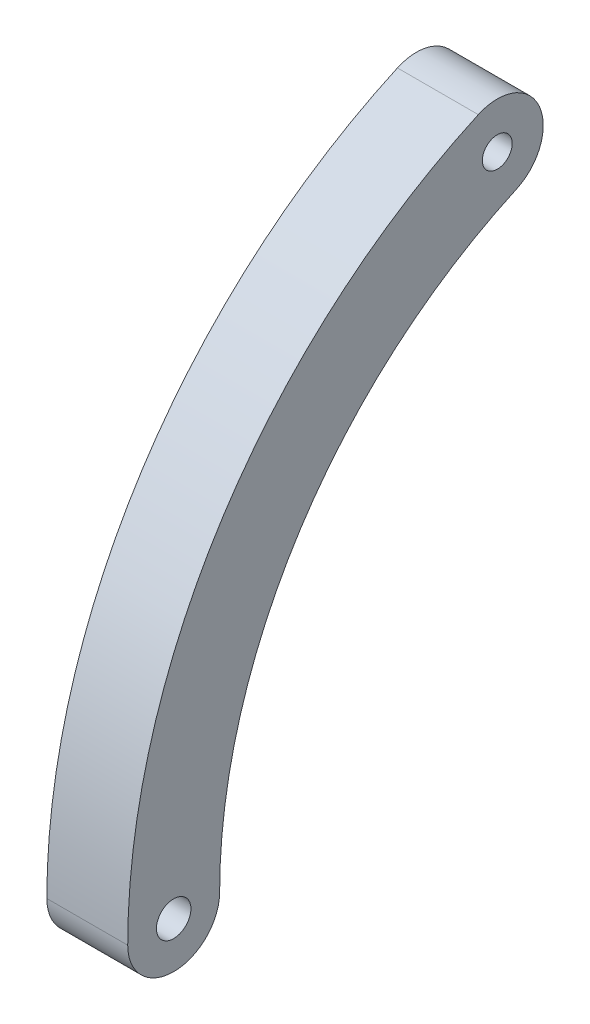
ISO-10303-21;
HEADER;
FILE_DESCRIPTION(('STEP AP214'),'2;1');
FILE_NAME('part.step','',(''),(''),'','','');
FILE_SCHEMA(('AUTOMOTIVE_DESIGN { 1 0 10303 214 1 1 1 1 }'));
ENDSEC;
DATA;
#1=APPLICATION_CONTEXT('core data for automotive mechanical design processes');
#2=APPLICATION_PROTOCOL_DEFINITION('international standard','automotive_design',2000,#1);
#3=PRODUCT_CONTEXT('',#1,'mechanical');
#4=PRODUCT('Part','Part','',(#3));
#5=PRODUCT_RELATED_PRODUCT_CATEGORY('part','',(#4));
#6=PRODUCT_DEFINITION_FORMATION('','',#4);
#7=PRODUCT_DEFINITION_CONTEXT('part definition',#1,'design');
#8=PRODUCT_DEFINITION('design','',#6,#7);
#9=PRODUCT_DEFINITION_SHAPE('','',#8);
#10=(LENGTH_UNIT() NAMED_UNIT(*) SI_UNIT(.MILLI.,.METRE.));
#11=(NAMED_UNIT(*) PLANE_ANGLE_UNIT() SI_UNIT($,.RADIAN.));
#12=(NAMED_UNIT(*) SI_UNIT($,.STERADIAN.) SOLID_ANGLE_UNIT());
#13=UNCERTAINTY_MEASURE_WITH_UNIT(LENGTH_MEASURE(1.E-05),#10,'distance_accuracy_value','');
#14=(GEOMETRIC_REPRESENTATION_CONTEXT(3) GLOBAL_UNCERTAINTY_ASSIGNED_CONTEXT((#13)) GLOBAL_UNIT_ASSIGNED_CONTEXT((#10,
#11,#12)) REPRESENTATION_CONTEXT('',''));
#15=CARTESIAN_POINT('',(0.,0.,0.));
#16=DIRECTION('',(0.,0.,1.));
#17=DIRECTION('',(1.,0.,0.));
#18=AXIS2_PLACEMENT_3D('',#15,#16,#17);
#19=CARTESIAN_POINT('',(5.588,0.,19.05));
#20=DIRECTION('',(1.,0.,0.));
#21=DIRECTION('',(0.,0.,-1.));
#22=AXIS2_PLACEMENT_3D('',#19,#20,#21);
#23=PLANE('',#22);
#24=CARTESIAN_POINT('',(5.588,34.6954915562757,15.7427083333333));
#25=DIRECTION('',(1.,0.,0.));
#26=DIRECTION('',(0.,0.,-1.));
#27=AXIS2_PLACEMENT_3D('',#24,#25,#26);
#28=CIRCLE('',#27,1.03187500000001);
#29=CARTESIAN_POINT('',(5.588,34.6954915562757,14.7108333333333));
#30=VERTEX_POINT('',#29);
#31=EDGE_CURVE('E102',#30,#30,#28,.T.);
#32=ORIENTED_EDGE('',*,*,#31,.F.);
#33=EDGE_LOOP('',(#32));
#34=FACE_BOUND('',#33,.T.);
#35=CARTESIAN_POINT('',(5.588,0.,38.1));
#36=DIRECTION('',(1.,0.,0.));
#37=DIRECTION('',(0.,0.,-1.));
#38=AXIS2_PLACEMENT_3D('',#35,#36,#37);
#39=CIRCLE('',#38,3.175);
#40=CARTESIAN_POINT('',(5.588,0.,41.275));
#41=VERTEX_POINT('',#40);
#42=CARTESIAN_POINT('',(5.588,0.,34.925));
#43=VERTEX_POINT('',#42);
#44=EDGE_CURVE('E87',#41,#43,#39,.T.);
#45=ORIENTED_EDGE('',*,*,#44,.T.);
#46=CARTESIAN_POINT('',(5.588,0.,0.));
#47=DIRECTION('',(-1.,0.,0.));
#48=DIRECTION('',(0.,0.,1.));
#49=AXIS2_PLACEMENT_3D('',#46,#47,#48);
#50=CIRCLE('',#49,34.925);
#51=CARTESIAN_POINT('',(5.588,31.8042005932527,14.4308159722222));
#52=VERTEX_POINT('',#51);
#53=EDGE_CURVE('E82',#43,#52,#50,.T.);
#54=ORIENTED_EDGE('',*,*,#53,.T.);
#55=CARTESIAN_POINT('',(5.588,34.6954915562757,15.7427083333333));
#56=DIRECTION('',(1.,0.,0.));
#57=DIRECTION('',(0.,0.,-1.));
#58=AXIS2_PLACEMENT_3D('',#55,#56,#57);
#59=CIRCLE('',#58,3.175);
#60=CARTESIAN_POINT('',(5.588,37.5867825192987,17.0546006944444));
#61=VERTEX_POINT('',#60);
#62=EDGE_CURVE('E85',#52,#61,#59,.T.);
#63=ORIENTED_EDGE('',*,*,#62,.T.);
#64=CARTESIAN_POINT('',(5.588,0.,0.));
#65=DIRECTION('',(1.,0.,0.));
#66=DIRECTION('',(0.,0.,1.));
#67=AXIS2_PLACEMENT_3D('',#64,#65,#66);
#68=CIRCLE('',#67,41.275);
#69=EDGE_CURVE('E52',#61,#41,#68,.T.);
#70=ORIENTED_EDGE('',*,*,#69,.T.);
#71=EDGE_LOOP('',(#45,#54,#63,#70));
#72=FACE_BOUND('',#71,.T.);
#73=CARTESIAN_POINT('',(5.588,0.,38.1));
#74=DIRECTION('',(1.,0.,0.));
#75=DIRECTION('',(0.,0.,-1.));
#76=AXIS2_PLACEMENT_3D('',#73,#74,#75);
#77=CIRCLE('',#76,1.190625);
#78=CARTESIAN_POINT('',(5.588,0.,36.909375));
#79=VERTEX_POINT('',#78);
#80=EDGE_CURVE('E117',#79,#79,#77,.T.);
#81=ORIENTED_EDGE('',*,*,#80,.F.);
#82=EDGE_LOOP('',(#81));
#83=FACE_BOUND('',#82,.T.);
#84=ADVANCED_FACE('F35',(#34,#72,#83),#23,.T.);
#85=CARTESIAN_POINT('',(0.,0.,19.05));
#86=DIRECTION('',(1.,0.,0.));
#87=DIRECTION('',(0.,0.,-1.));
#88=AXIS2_PLACEMENT_3D('',#85,#86,#87);
#89=PLANE('',#88);
#90=CARTESIAN_POINT('',(0.,0.,38.1));
#91=DIRECTION('',(1.,0.,0.));
#92=DIRECTION('',(0.,0.,-1.));
#93=AXIS2_PLACEMENT_3D('',#90,#91,#92);
#94=CIRCLE('',#93,3.175);
#95=CARTESIAN_POINT('',(0.,0.,41.275));
#96=VERTEX_POINT('',#95);
#97=CARTESIAN_POINT('',(0.,0.,34.925));
#98=VERTEX_POINT('',#97);
#99=EDGE_CURVE('E99',#96,#98,#94,.T.);
#100=ORIENTED_EDGE('',*,*,#99,.F.);
#101=CARTESIAN_POINT('',(0.,0.,0.));
#102=DIRECTION('',(1.,0.,0.));
#103=DIRECTION('',(0.,0.,1.));
#104=AXIS2_PLACEMENT_3D('',#101,#102,#103);
#105=CIRCLE('',#104,41.275);
#106=CARTESIAN_POINT('',(0.,37.5867825192987,17.0546006944444));
#107=VERTEX_POINT('',#106);
#108=EDGE_CURVE('E75',#107,#96,#105,.T.);
#109=ORIENTED_EDGE('',*,*,#108,.F.);
#110=CARTESIAN_POINT('',(0.,34.6954915562757,15.7427083333333));
#111=DIRECTION('',(1.,0.,0.));
#112=DIRECTION('',(0.,0.,-1.));
#113=AXIS2_PLACEMENT_3D('',#110,#111,#112);
#114=CIRCLE('',#113,3.175);
#115=CARTESIAN_POINT('',(0.,31.8042005932527,14.4308159722222));
#116=VERTEX_POINT('',#115);
#117=EDGE_CURVE('E69',#116,#107,#114,.T.);
#118=ORIENTED_EDGE('',*,*,#117,.F.);
#119=CARTESIAN_POINT('',(0.,0.,0.));
#120=DIRECTION('',(-1.,0.,0.));
#121=DIRECTION('',(0.,0.,1.));
#122=AXIS2_PLACEMENT_3D('',#119,#120,#121);
#123=CIRCLE('',#122,34.925);
#124=EDGE_CURVE('E91',#98,#116,#123,.T.);
#125=ORIENTED_EDGE('',*,*,#124,.F.);
#126=EDGE_LOOP('',(#100,#109,#118,#125));
#127=FACE_BOUND('',#126,.T.);
#128=CARTESIAN_POINT('',(0.,34.6954915562757,15.7427083333333));
#129=DIRECTION('',(1.,0.,0.));
#130=DIRECTION('',(0.,0.,-1.));
#131=AXIS2_PLACEMENT_3D('',#128,#129,#130);
#132=CIRCLE('',#131,1.03187500000001);
#133=CARTESIAN_POINT('',(0.,34.6954915562757,14.7108333333333));
#134=VERTEX_POINT('',#133);
#135=EDGE_CURVE('E114',#134,#134,#132,.T.);
#136=ORIENTED_EDGE('',*,*,#135,.T.);
#137=EDGE_LOOP('',(#136));
#138=FACE_BOUND('',#137,.T.);
#139=CARTESIAN_POINT('',(0.,0.,38.1));
#140=DIRECTION('',(1.,0.,0.));
#141=DIRECTION('',(0.,0.,-1.));
#142=AXIS2_PLACEMENT_3D('',#139,#140,#141);
#143=CIRCLE('',#142,1.190625);
#144=CARTESIAN_POINT('',(0.,0.,36.909375));
#145=VERTEX_POINT('',#144);
#146=EDGE_CURVE('E120',#145,#145,#143,.T.);
#147=ORIENTED_EDGE('',*,*,#146,.T.);
#148=EDGE_LOOP('',(#147));
#149=FACE_BOUND('',#148,.T.);
#150=ADVANCED_FACE('F110',(#127,#138,#149),#89,.F.);
#151=CARTESIAN_POINT('',(5.588,0.,38.1));
#152=DIRECTION('',(-1.,0.,0.));
#153=DIRECTION('',(0.,0.,1.));
#154=AXIS2_PLACEMENT_3D('',#151,#152,#153);
#155=CYLINDRICAL_SURFACE('',#154,3.175);
#156=ORIENTED_EDGE('',*,*,#99,.T.);
#157=DIRECTION('',(-1.,0.,0.));
#158=VECTOR('',#157,1.);
#159=CARTESIAN_POINT('',(5.588,0.,34.925));
#160=LINE('',#159,#158);
#161=EDGE_CURVE('E11',#43,#98,#160,.T.);
#162=ORIENTED_EDGE('',*,*,#161,.F.);
#163=ORIENTED_EDGE('',*,*,#44,.F.);
#164=DIRECTION('',(-1.,0.,0.));
#165=VECTOR('',#164,1.);
#166=CARTESIAN_POINT('',(5.588,0.,41.275));
#167=LINE('',#166,#165);
#168=EDGE_CURVE('E95',#41,#96,#167,.T.);
#169=ORIENTED_EDGE('',*,*,#168,.T.);
#170=EDGE_LOOP('',(#156,#162,#163,#169));
#171=FACE_BOUND('',#170,.T.);
#172=ADVANCED_FACE('F37',(#171),#155,.T.);
#173=CARTESIAN_POINT('',(5.588,0.,0.));
#174=DIRECTION('',(-1.,0.,0.));
#175=DIRECTION('',(0.,0.,1.));
#176=AXIS2_PLACEMENT_3D('',#173,#174,#175);
#177=CYLINDRICAL_SURFACE('',#176,34.925);
#178=ORIENTED_EDGE('',*,*,#124,.T.);
#179=DIRECTION('',(-1.,0.,0.));
#180=VECTOR('',#179,1.);
#181=CARTESIAN_POINT('',(5.588,31.8042005932527,14.4308159722222));
#182=LINE('',#181,#180);
#183=EDGE_CURVE('E44',#52,#116,#182,.T.);
#184=ORIENTED_EDGE('',*,*,#183,.F.);
#185=ORIENTED_EDGE('',*,*,#53,.F.);
#186=ORIENTED_EDGE('',*,*,#161,.T.);
#187=EDGE_LOOP('',(#178,#184,#185,#186));
#188=FACE_BOUND('',#187,.T.);
#189=ADVANCED_FACE('F90',(#188),#177,.F.);
#190=CARTESIAN_POINT('',(5.588,34.6954915562757,15.7427083333333));
#191=DIRECTION('',(-1.,0.,0.));
#192=DIRECTION('',(0.,0.,1.));
#193=AXIS2_PLACEMENT_3D('',#190,#191,#192);
#194=CYLINDRICAL_SURFACE('',#193,3.175);
#195=ORIENTED_EDGE('',*,*,#117,.T.);
#196=DIRECTION('',(-1.,0.,0.));
#197=VECTOR('',#196,1.);
#198=CARTESIAN_POINT('',(5.588,37.5867825192987,17.0546006944444));
#199=LINE('',#198,#197);
#200=EDGE_CURVE('E92',#61,#107,#199,.T.);
#201=ORIENTED_EDGE('',*,*,#200,.F.);
#202=ORIENTED_EDGE('',*,*,#62,.F.);
#203=ORIENTED_EDGE('',*,*,#183,.T.);
#204=EDGE_LOOP('',(#195,#201,#202,#203));
#205=FACE_BOUND('',#204,.T.);
#206=ADVANCED_FACE('F93',(#205),#194,.T.);
#207=CARTESIAN_POINT('',(5.588,0.,0.));
#208=DIRECTION('',(-1.,0.,0.));
#209=DIRECTION('',(0.,0.,1.));
#210=AXIS2_PLACEMENT_3D('',#207,#208,#209);
#211=CYLINDRICAL_SURFACE('',#210,41.275);
#212=ORIENTED_EDGE('',*,*,#108,.T.);
#213=ORIENTED_EDGE('',*,*,#168,.F.);
#214=ORIENTED_EDGE('',*,*,#69,.F.);
#215=ORIENTED_EDGE('',*,*,#200,.T.);
#216=EDGE_LOOP('',(#212,#213,#214,#215));
#217=FACE_BOUND('',#216,.T.);
#218=ADVANCED_FACE('F107',(#217),#211,.T.);
#219=CARTESIAN_POINT('',(5.588,34.6954915562757,15.7427083333333));
#220=DIRECTION('',(-1.,0.,0.));
#221=DIRECTION('',(0.,0.,1.));
#222=AXIS2_PLACEMENT_3D('',#219,#220,#221);
#223=CYLINDRICAL_SURFACE('',#222,1.03187500000001);
#224=ORIENTED_EDGE('',*,*,#31,.T.);
#225=EDGE_LOOP('',(#224));
#226=FACE_BOUND('',#225,.T.);
#227=ORIENTED_EDGE('',*,*,#135,.F.);
#228=EDGE_LOOP('',(#227));
#229=FACE_BOUND('',#228,.T.);
#230=ADVANCED_FACE('F137',(#226,#229),#223,.F.);
#231=CARTESIAN_POINT('',(5.588,0.,38.1));
#232=DIRECTION('',(-1.,0.,0.));
#233=DIRECTION('',(0.,0.,1.));
#234=AXIS2_PLACEMENT_3D('',#231,#232,#233);
#235=CYLINDRICAL_SURFACE('',#234,1.190625);
#236=ORIENTED_EDGE('',*,*,#80,.T.);
#237=EDGE_LOOP('',(#236));
#238=FACE_BOUND('',#237,.T.);
#239=ORIENTED_EDGE('',*,*,#146,.F.);
#240=EDGE_LOOP('',(#239));
#241=FACE_BOUND('',#240,.T.);
#242=ADVANCED_FACE('F126',(#238,#241),#235,.F.);
#243=CLOSED_SHELL('',(#84,#150,#172,#189,#206,#218,#230,#242));
#244=MANIFOLD_SOLID_BREP('B2',#243);
#245=ADVANCED_BREP_SHAPE_REPRESENTATION('',(#18,#244),#14);
#246=SHAPE_DEFINITION_REPRESENTATION(#9,#245);
ENDSEC;
END-ISO-10303-21;
